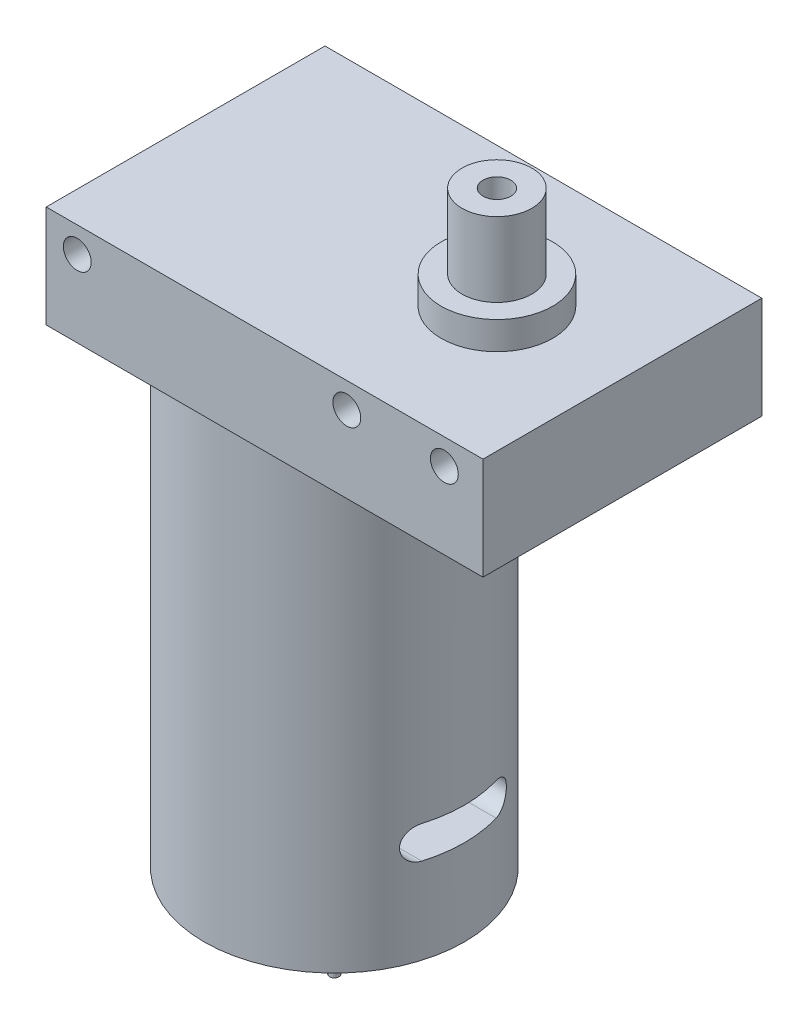
ISO-10303-21;
HEADER;
FILE_DESCRIPTION(('STEP AP214'),'2;1');
FILE_NAME('part.step','',(''),(''),'','','');
FILE_SCHEMA(('AUTOMOTIVE_DESIGN { 1 0 10303 214 1 1 1 1 }'));
ENDSEC;
DATA;
#1=APPLICATION_CONTEXT('core data for automotive mechanical design processes');
#2=APPLICATION_PROTOCOL_DEFINITION('international standard','automotive_design',2000,#1);
#3=PRODUCT_CONTEXT('',#1,'mechanical');
#4=PRODUCT('Part','Part','',(#3));
#5=PRODUCT_RELATED_PRODUCT_CATEGORY('part','',(#4));
#6=PRODUCT_DEFINITION_FORMATION('','',#4);
#7=PRODUCT_DEFINITION_CONTEXT('part definition',#1,'design');
#8=PRODUCT_DEFINITION('design','',#6,#7);
#9=PRODUCT_DEFINITION_SHAPE('','',#8);
#10=(LENGTH_UNIT() NAMED_UNIT(*) SI_UNIT(.MILLI.,.METRE.));
#11=(NAMED_UNIT(*) PLANE_ANGLE_UNIT() SI_UNIT($,.RADIAN.));
#12=(NAMED_UNIT(*) SI_UNIT($,.STERADIAN.) SOLID_ANGLE_UNIT());
#13=UNCERTAINTY_MEASURE_WITH_UNIT(LENGTH_MEASURE(1.E-05),#10,'distance_accuracy_value','');
#14=(GEOMETRIC_REPRESENTATION_CONTEXT(3) GLOBAL_UNCERTAINTY_ASSIGNED_CONTEXT((#13)) GLOBAL_UNIT_ASSIGNED_CONTEXT((#10,
#11,#12)) REPRESENTATION_CONTEXT('',''));
#15=CARTESIAN_POINT('',(0.,0.,0.));
#16=DIRECTION('',(0.,0.,1.));
#17=DIRECTION('',(1.,0.,0.));
#18=AXIS2_PLACEMENT_3D('',#15,#16,#17);
#19=CARTESIAN_POINT('',(16.,-52.,15.));
#20=DIRECTION('',(0.,-1.,0.));
#21=DIRECTION('',(0.,0.,-1.));
#22=AXIS2_PLACEMENT_3D('',#19,#20,#21);
#23=PLANE('',#22);
#24=CARTESIAN_POINT('',(16.,-52.,15.));
#25=DIRECTION('',(0.,-1.,0.));
#26=DIRECTION('',(0.,0.,-1.));
#27=AXIS2_PLACEMENT_3D('',#24,#25,#26);
#28=CIRCLE('',#27,5.);
#29=CARTESIAN_POINT('',(16.,-52.,10.));
#30=VERTEX_POINT('',#29);
#31=EDGE_CURVE('E200',#30,#30,#28,.T.);
#32=ORIENTED_EDGE('',*,*,#31,.T.);
#33=EDGE_LOOP('',(#32));
#34=FACE_BOUND('',#33,.T.);
#35=CARTESIAN_POINT('',(16.,-52.,15.));
#36=DIRECTION('',(0.,-1.,0.));
#37=DIRECTION('',(0.,0.,-1.));
#38=AXIS2_PLACEMENT_3D('',#35,#36,#37);
#39=CIRCLE('',#38,0.499999999999999);
#40=CARTESIAN_POINT('',(16.,-52.,14.5));
#41=VERTEX_POINT('',#40);
#42=EDGE_CURVE('E342',#41,#41,#39,.T.);
#43=ORIENTED_EDGE('',*,*,#42,.F.);
#44=EDGE_LOOP('',(#43));
#45=FACE_BOUND('',#44,.T.);
#46=ADVANCED_FACE('F36',(#34,#45),#23,.T.);
#47=CARTESIAN_POINT('',(16.,-50.,15.));
#48=DIRECTION('',(0.,-1.,0.));
#49=DIRECTION('',(0.,0.,-1.));
#50=AXIS2_PLACEMENT_3D('',#47,#48,#49);
#51=PLANE('',#50);
#52=CARTESIAN_POINT('',(16.,-50.,15.));
#53=DIRECTION('',(0.,-1.,0.));
#54=DIRECTION('',(0.,0.,-1.));
#55=AXIS2_PLACEMENT_3D('',#52,#53,#54);
#56=CIRCLE('',#55,14.);
#57=CARTESIAN_POINT('',(16.,-50.,0.999999999999999));
#58=VERTEX_POINT('',#57);
#59=EDGE_CURVE('E195',#58,#58,#56,.T.);
#60=ORIENTED_EDGE('',*,*,#59,.T.);
#61=EDGE_LOOP('',(#60));
#62=FACE_BOUND('',#61,.T.);
#63=CARTESIAN_POINT('',(16.,-50.,15.));
#64=DIRECTION('',(0.,-1.,0.));
#65=DIRECTION('',(0.,0.,-1.));
#66=AXIS2_PLACEMENT_3D('',#63,#64,#65);
#67=CIRCLE('',#66,5.);
#68=CARTESIAN_POINT('',(16.,-50.,10.));
#69=VERTEX_POINT('',#68);
#70=EDGE_CURVE('E198',#69,#69,#67,.T.);
#71=ORIENTED_EDGE('',*,*,#70,.F.);
#72=EDGE_LOOP('',(#71));
#73=FACE_BOUND('',#72,.T.);
#74=ADVANCED_FACE('F179',(#62,#73),#51,.T.);
#75=CARTESIAN_POINT('',(0.,0.,0.));
#76=DIRECTION('',(0.,1.,0.));
#77=DIRECTION('',(0.,0.,1.));
#78=AXIS2_PLACEMENT_3D('',#75,#76,#77);
#79=PLANE('',#78);
#80=DIRECTION('',(0.,0.,1.));
#81=VECTOR('',#80,1.);
#82=CARTESIAN_POINT('',(0.,0.,0.));
#83=LINE('',#82,#81);
#84=CARTESIAN_POINT('',(0.,0.,0.));
#85=VERTEX_POINT('',#84);
#86=CARTESIAN_POINT('',(0.,0.,30.));
#87=VERTEX_POINT('',#86);
#88=EDGE_CURVE('E221',#85,#87,#83,.T.);
#89=ORIENTED_EDGE('',*,*,#88,.F.);
#90=DIRECTION('',(-1.,0.,0.));
#91=VECTOR('',#90,1.);
#92=CARTESIAN_POINT('',(0.,0.,0.));
#93=LINE('',#92,#91);
#94=CARTESIAN_POINT('',(47.,0.,0.));
#95=VERTEX_POINT('',#94);
#96=EDGE_CURVE('E228',#95,#85,#93,.T.);
#97=ORIENTED_EDGE('',*,*,#96,.F.);
#98=DIRECTION('',(0.,0.,-1.));
#99=VECTOR('',#98,1.);
#100=CARTESIAN_POINT('',(47.,0.,0.));
#101=LINE('',#100,#99);
#102=CARTESIAN_POINT('',(47.,0.,30.));
#103=VERTEX_POINT('',#102);
#104=EDGE_CURVE('E239',#103,#95,#101,.T.);
#105=ORIENTED_EDGE('',*,*,#104,.F.);
#106=DIRECTION('',(1.,0.,0.));
#107=VECTOR('',#106,1.);
#108=CARTESIAN_POINT('',(0.,0.,30.));
#109=LINE('',#108,#107);
#110=EDGE_CURVE('E237',#87,#103,#109,.T.);
#111=ORIENTED_EDGE('',*,*,#110,.F.);
#112=EDGE_LOOP('',(#89,#97,#105,#111));
#113=FACE_BOUND('',#112,.T.);
#114=CARTESIAN_POINT('',(16.,0.,15.));
#115=DIRECTION('',(0.,1.,0.));
#116=DIRECTION('',(0.,0.,1.));
#117=AXIS2_PLACEMENT_3D('',#114,#115,#116);
#118=CIRCLE('',#117,14.);
#119=CARTESIAN_POINT('',(16.,0.,29.));
#120=VERTEX_POINT('',#119);
#121=EDGE_CURVE('E133',#120,#120,#118,.F.);
#122=ORIENTED_EDGE('',*,*,#121,.F.);
#123=EDGE_LOOP('',(#122));
#124=FACE_BOUND('',#123,.T.);
#125=ADVANCED_FACE('F184',(#113,#124),#79,.F.);
#126=CARTESIAN_POINT('',(33.5,14.,15.));
#127=DIRECTION('',(0.,1.,0.));
#128=DIRECTION('',(0.,0.,1.));
#129=AXIS2_PLACEMENT_3D('',#126,#127,#128);
#130=PLANE('',#129);
#131=CARTESIAN_POINT('',(33.5,14.,15.));
#132=DIRECTION('',(0.,1.,0.));
#133=DIRECTION('',(0.,0.,1.));
#134=AXIS2_PLACEMENT_3D('',#131,#132,#133);
#135=CIRCLE('',#134,5.99999999999999);
#136=CARTESIAN_POINT('',(33.5,14.,21.));
#137=VERTEX_POINT('',#136);
#138=EDGE_CURVE('E218',#137,#137,#135,.T.);
#139=ORIENTED_EDGE('',*,*,#138,.T.);
#140=EDGE_LOOP('',(#139));
#141=FACE_BOUND('',#140,.T.);
#142=CARTESIAN_POINT('',(33.5,14.,15.));
#143=DIRECTION('',(0.,1.,0.));
#144=DIRECTION('',(0.,0.,1.));
#145=AXIS2_PLACEMENT_3D('',#142,#143,#144);
#146=CIRCLE('',#145,3.75277674973257);
#147=CARTESIAN_POINT('',(33.5,14.,18.7527767497326));
#148=VERTEX_POINT('',#147);
#149=EDGE_CURVE('E211',#148,#148,#146,.T.);
#150=ORIENTED_EDGE('',*,*,#149,.F.);
#151=EDGE_LOOP('',(#150));
#152=FACE_BOUND('',#151,.T.);
#153=ADVANCED_FACE('F189',(#141,#152),#130,.T.);
#154=CARTESIAN_POINT('',(0.,11.,0.));
#155=DIRECTION('',(0.,1.,0.));
#156=DIRECTION('',(0.,0.,1.));
#157=AXIS2_PLACEMENT_3D('',#154,#155,#156);
#158=PLANE('',#157);
#159=DIRECTION('',(0.,0.,1.));
#160=VECTOR('',#159,1.);
#161=CARTESIAN_POINT('',(0.,11.,0.));
#162=LINE('',#161,#160);
#163=CARTESIAN_POINT('',(0.,11.,0.));
#164=VERTEX_POINT('',#163);
#165=CARTESIAN_POINT('',(0.,11.,30.));
#166=VERTEX_POINT('',#165);
#167=EDGE_CURVE('E224',#164,#166,#162,.T.);
#168=ORIENTED_EDGE('',*,*,#167,.T.);
#169=DIRECTION('',(1.,0.,0.));
#170=VECTOR('',#169,1.);
#171=CARTESIAN_POINT('',(0.,11.,30.));
#172=LINE('',#171,#170);
#173=CARTESIAN_POINT('',(47.,11.,30.));
#174=VERTEX_POINT('',#173);
#175=EDGE_CURVE('E227',#166,#174,#172,.T.);
#176=ORIENTED_EDGE('',*,*,#175,.T.);
#177=DIRECTION('',(0.,0.,-1.));
#178=VECTOR('',#177,1.);
#179=CARTESIAN_POINT('',(47.,11.,0.));
#180=LINE('',#179,#178);
#181=CARTESIAN_POINT('',(47.,11.,0.));
#182=VERTEX_POINT('',#181);
#183=EDGE_CURVE('E230',#174,#182,#180,.T.);
#184=ORIENTED_EDGE('',*,*,#183,.T.);
#185=DIRECTION('',(-1.,0.,0.));
#186=VECTOR('',#185,1.);
#187=CARTESIAN_POINT('',(0.,11.,0.));
#188=LINE('',#187,#186);
#189=EDGE_CURVE('E232',#182,#164,#188,.T.);
#190=ORIENTED_EDGE('',*,*,#189,.T.);
#191=EDGE_LOOP('',(#168,#176,#184,#190));
#192=FACE_BOUND('',#191,.T.);
#193=CARTESIAN_POINT('',(33.5,11.,15.));
#194=DIRECTION('',(0.,1.,0.));
#195=DIRECTION('',(0.,0.,1.));
#196=AXIS2_PLACEMENT_3D('',#193,#194,#195);
#197=CIRCLE('',#196,5.99999999999999);
#198=CARTESIAN_POINT('',(33.5,11.,21.));
#199=VERTEX_POINT('',#198);
#200=EDGE_CURVE('E215',#199,#199,#197,.T.);
#201=ORIENTED_EDGE('',*,*,#200,.F.);
#202=EDGE_LOOP('',(#201));
#203=FACE_BOUND('',#202,.T.);
#204=ADVANCED_FACE('F274',(#192,#203),#158,.T.);
#205=CARTESIAN_POINT('',(0.,11.,0.));
#206=DIRECTION('',(1.,0.,0.));
#207=DIRECTION('',(0.,0.,-1.));
#208=AXIS2_PLACEMENT_3D('',#205,#206,#207);
#209=PLANE('',#208);
#210=ORIENTED_EDGE('',*,*,#88,.T.);
#211=DIRECTION('',(0.,-1.,0.));
#212=VECTOR('',#211,1.);
#213=CARTESIAN_POINT('',(0.,11.,30.));
#214=LINE('',#213,#212);
#215=EDGE_CURVE('E250',#166,#87,#214,.T.);
#216=ORIENTED_EDGE('',*,*,#215,.F.);
#217=ORIENTED_EDGE('',*,*,#167,.F.);
#218=DIRECTION('',(0.,-1.,0.));
#219=VECTOR('',#218,1.);
#220=CARTESIAN_POINT('',(0.,11.,0.));
#221=LINE('',#220,#219);
#222=EDGE_CURVE('E234',#164,#85,#221,.T.);
#223=ORIENTED_EDGE('',*,*,#222,.T.);
#224=EDGE_LOOP('',(#210,#216,#217,#223));
#225=FACE_BOUND('',#224,.T.);
#226=ADVANCED_FACE('F38',(#225),#209,.F.);
#227=CARTESIAN_POINT('',(0.,11.,30.));
#228=DIRECTION('',(0.,0.,-1.));
#229=DIRECTION('',(-1.,0.,0.));
#230=AXIS2_PLACEMENT_3D('',#227,#228,#229);
#231=PLANE('',#230);
#232=CARTESIAN_POINT('',(42.8407573826274,8.25,30.));
#233=DIRECTION('',(0.,0.,1.));
#234=DIRECTION('',(1.,0.,0.));
#235=AXIS2_PLACEMENT_3D('',#232,#233,#234);
#236=CIRCLE('',#235,1.5);
#237=CARTESIAN_POINT('',(44.3407573826274,8.25,30.));
#238=VERTEX_POINT('',#237);
#239=EDGE_CURVE('E299',#238,#238,#236,.T.);
#240=ORIENTED_EDGE('',*,*,#239,.F.);
#241=EDGE_LOOP('',(#240));
#242=FACE_BOUND('',#241,.T.);
#243=CARTESIAN_POINT('',(32.3407573826274,8.25,30.));
#244=DIRECTION('',(0.,0.,1.));
#245=DIRECTION('',(1.,0.,0.));
#246=AXIS2_PLACEMENT_3D('',#243,#244,#245);
#247=CIRCLE('',#246,1.5);
#248=CARTESIAN_POINT('',(33.8407573826274,8.25,30.));
#249=VERTEX_POINT('',#248);
#250=EDGE_CURVE('E303',#249,#249,#247,.T.);
#251=ORIENTED_EDGE('',*,*,#250,.F.);
#252=EDGE_LOOP('',(#251));
#253=FACE_BOUND('',#252,.T.);
#254=CARTESIAN_POINT('',(3.34075738262738,8.25,30.));
#255=DIRECTION('',(0.,0.,1.));
#256=DIRECTION('',(1.,0.,0.));
#257=AXIS2_PLACEMENT_3D('',#254,#255,#256);
#258=CIRCLE('',#257,1.5);
#259=CARTESIAN_POINT('',(4.84075738262738,8.25,30.));
#260=VERTEX_POINT('',#259);
#261=EDGE_CURVE('E206',#260,#260,#258,.T.);
#262=ORIENTED_EDGE('',*,*,#261,.F.);
#263=EDGE_LOOP('',(#262));
#264=FACE_BOUND('',#263,.T.);
#265=ORIENTED_EDGE('',*,*,#110,.T.);
#266=DIRECTION('',(0.,-1.,0.));
#267=VECTOR('',#266,1.);
#268=CARTESIAN_POINT('',(47.,11.,30.));
#269=LINE('',#268,#267);
#270=EDGE_CURVE('E247',#174,#103,#269,.T.);
#271=ORIENTED_EDGE('',*,*,#270,.F.);
#272=ORIENTED_EDGE('',*,*,#175,.F.);
#273=ORIENTED_EDGE('',*,*,#215,.T.);
#274=EDGE_LOOP('',(#265,#271,#272,#273));
#275=FACE_BOUND('',#274,.T.);
#276=ADVANCED_FACE('F288',(#242,#253,#264,#275),#231,.F.);
#277=CARTESIAN_POINT('',(47.,11.,0.));
#278=DIRECTION('',(-1.,0.,0.));
#279=DIRECTION('',(0.,0.,1.));
#280=AXIS2_PLACEMENT_3D('',#277,#278,#279);
#281=PLANE('',#280);
#282=ORIENTED_EDGE('',*,*,#104,.T.);
#283=DIRECTION('',(0.,-1.,0.));
#284=VECTOR('',#283,1.);
#285=CARTESIAN_POINT('',(47.,11.,0.));
#286=LINE('',#285,#284);
#287=EDGE_CURVE('E244',#182,#95,#286,.T.);
#288=ORIENTED_EDGE('',*,*,#287,.F.);
#289=ORIENTED_EDGE('',*,*,#183,.F.);
#290=ORIENTED_EDGE('',*,*,#270,.T.);
#291=EDGE_LOOP('',(#282,#288,#289,#290));
#292=FACE_BOUND('',#291,.T.);
#293=ADVANCED_FACE('F285',(#292),#281,.F.);
#294=CARTESIAN_POINT('',(0.,11.,0.));
#295=DIRECTION('',(0.,0.,1.));
#296=DIRECTION('',(1.,0.,0.));
#297=AXIS2_PLACEMENT_3D('',#294,#295,#296);
#298=PLANE('',#297);
#299=CARTESIAN_POINT('',(42.8407573826274,8.25,0.));
#300=DIRECTION('',(0.,0.,1.));
#301=DIRECTION('',(1.,0.,0.));
#302=AXIS2_PLACEMENT_3D('',#299,#300,#301);
#303=CIRCLE('',#302,1.5);
#304=CARTESIAN_POINT('',(44.3407573826274,8.25,0.));
#305=VERTEX_POINT('',#304);
#306=EDGE_CURVE('E326',#305,#305,#303,.T.);
#307=ORIENTED_EDGE('',*,*,#306,.T.);
#308=EDGE_LOOP('',(#307));
#309=FACE_BOUND('',#308,.T.);
#310=CARTESIAN_POINT('',(32.3407573826274,8.25,0.));
#311=DIRECTION('',(0.,0.,1.));
#312=DIRECTION('',(1.,0.,0.));
#313=AXIS2_PLACEMENT_3D('',#310,#311,#312);
#314=CIRCLE('',#313,1.5);
#315=CARTESIAN_POINT('',(33.8407573826274,8.25,0.));
#316=VERTEX_POINT('',#315);
#317=EDGE_CURVE('E322',#316,#316,#314,.T.);
#318=ORIENTED_EDGE('',*,*,#317,.T.);
#319=EDGE_LOOP('',(#318));
#320=FACE_BOUND('',#319,.T.);
#321=CARTESIAN_POINT('',(3.34075738262738,8.25,0.));
#322=DIRECTION('',(0.,0.,1.));
#323=DIRECTION('',(1.,0.,0.));
#324=AXIS2_PLACEMENT_3D('',#321,#322,#323);
#325=CIRCLE('',#324,1.5);
#326=CARTESIAN_POINT('',(4.84075738262738,8.25,0.));
#327=VERTEX_POINT('',#326);
#328=EDGE_CURVE('E201',#327,#327,#325,.T.);
#329=ORIENTED_EDGE('',*,*,#328,.T.);
#330=EDGE_LOOP('',(#329));
#331=FACE_BOUND('',#330,.T.);
#332=ORIENTED_EDGE('',*,*,#96,.T.);
#333=ORIENTED_EDGE('',*,*,#222,.F.);
#334=ORIENTED_EDGE('',*,*,#189,.F.);
#335=ORIENTED_EDGE('',*,*,#287,.T.);
#336=EDGE_LOOP('',(#332,#333,#334,#335));
#337=FACE_BOUND('',#336,.T.);
#338=ADVANCED_FACE('F278',(#309,#320,#331,#337),#298,.F.);
#339=CARTESIAN_POINT('',(33.5,14.,15.));
#340=DIRECTION('',(0.,-1.,0.));
#341=DIRECTION('',(0.,0.,-1.));
#342=AXIS2_PLACEMENT_3D('',#339,#340,#341);
#343=CYLINDRICAL_SURFACE('',#342,5.99999999999999);
#344=ORIENTED_EDGE('',*,*,#138,.F.);
#345=EDGE_LOOP('',(#344));
#346=FACE_BOUND('',#345,.T.);
#347=ORIENTED_EDGE('',*,*,#200,.T.);
#348=EDGE_LOOP('',(#347));
#349=FACE_BOUND('',#348,.T.);
#350=ADVANCED_FACE('F266',(#346,#349),#343,.T.);
#351=CARTESIAN_POINT('',(33.5,22.,15.));
#352=DIRECTION('',(0.,-1.,0.));
#353=DIRECTION('',(0.,0.,-1.));
#354=AXIS2_PLACEMENT_3D('',#351,#352,#353);
#355=CYLINDRICAL_SURFACE('',#354,3.75277674973257);
#356=CARTESIAN_POINT('',(33.5,22.,15.));
#357=DIRECTION('',(0.,1.,0.));
#358=DIRECTION('',(0.,0.,1.));
#359=AXIS2_PLACEMENT_3D('',#356,#357,#358);
#360=CIRCLE('',#359,3.75277674973257);
#361=CARTESIAN_POINT('',(33.5,22.,18.7527767497326));
#362=VERTEX_POINT('',#361);
#363=EDGE_CURVE('E212',#362,#362,#360,.T.);
#364=ORIENTED_EDGE('',*,*,#363,.F.);
#365=EDGE_LOOP('',(#364));
#366=FACE_BOUND('',#365,.T.);
#367=ORIENTED_EDGE('',*,*,#149,.T.);
#368=EDGE_LOOP('',(#367));
#369=FACE_BOUND('',#368,.T.);
#370=ADVANCED_FACE('F261',(#366,#369),#355,.T.);
#371=CARTESIAN_POINT('',(33.5,22.,15.));
#372=DIRECTION('',(0.,1.,0.));
#373=DIRECTION('',(0.,0.,1.));
#374=AXIS2_PLACEMENT_3D('',#371,#372,#373);
#375=PLANE('',#374);
#376=CARTESIAN_POINT('',(33.5,22.,15.));
#377=DIRECTION('',(0.,1.,0.));
#378=DIRECTION('',(0.,0.,1.));
#379=AXIS2_PLACEMENT_3D('',#376,#377,#378);
#380=CIRCLE('',#379,1.5);
#381=CARTESIAN_POINT('',(33.5,22.,16.5));
#382=VERTEX_POINT('',#381);
#383=EDGE_CURVE('E336',#382,#382,#380,.T.);
#384=ORIENTED_EDGE('',*,*,#383,.F.);
#385=EDGE_LOOP('',(#384));
#386=FACE_BOUND('',#385,.T.);
#387=ORIENTED_EDGE('',*,*,#363,.T.);
#388=EDGE_LOOP('',(#387));
#389=FACE_BOUND('',#388,.T.);
#390=ADVANCED_FACE('F257',(#386,#389),#375,.T.);
#391=CARTESIAN_POINT('',(16.,-50.,15.));
#392=DIRECTION('',(0.,1.,0.));
#393=DIRECTION('',(0.,0.,1.));
#394=AXIS2_PLACEMENT_3D('',#391,#392,#393);
#395=CYLINDRICAL_SURFACE('',#394,14.);
#396=CARTESIAN_POINT('',(16.,-37.25,15.));
#397=DIRECTION('',(0.,1.,0.));
#398=DIRECTION('',(0.,0.,1.));
#399=AXIS2_PLACEMENT_3D('',#396,#397,#398);
#400=CIRCLE('',#399,14.);
#401=CARTESIAN_POINT('',(29.4164078649987,-37.25,19.));
#402=VERTEX_POINT('',#401);
#403=CARTESIAN_POINT('',(29.4164078649987,-37.25,11.));
#404=VERTEX_POINT('',#403);
#405=EDGE_CURVE('E50',#402,#404,#400,.T.);
#406=ORIENTED_EDGE('',*,*,#405,.T.);
#407=CARTESIAN_POINT('',(29.4164078649987,-37.25,11.));
#408=CARTESIAN_POINT('',(29.4009505736263,-37.2500013571118,10.9481484949685));
#409=CARTESIAN_POINT('',(29.3851973115395,-37.2523055307532,10.8964157711557));
#410=CARTESIAN_POINT('',(29.3532147991357,-37.2614565880063,10.793510955877));
#411=CARTESIAN_POINT('',(29.3369856267093,-37.2683027321719,10.7423387745314));
#412=CARTESIAN_POINT('',(29.2877938697727,-37.2955368395137,10.5902565545779));
#413=CARTESIAN_POINT('',(29.2542855074683,-37.3226208280629,10.4906418556386));
#414=CARTESIAN_POINT('',(29.1871085445877,-37.3937618037879,10.2978066692511));
#415=CARTESIAN_POINT('',(29.1534399584964,-37.4378172844213,10.2045856151103));
#416=CARTESIAN_POINT('',(29.0873160978216,-37.5418242311756,10.0269589491946));
#417=CARTESIAN_POINT('',(29.0548608734129,-37.6017763538264,9.94255370171244));
#418=CARTESIAN_POINT('',(28.9927082129094,-37.7363129722698,9.78495172650631));
#419=CARTESIAN_POINT('',(28.9630137347517,-37.8109129018539,9.71176696745845));
#420=CARTESIAN_POINT('',(28.9081408210273,-37.9729763720471,9.57920123949276));
#421=CARTESIAN_POINT('',(28.8829612012622,-38.0604365285721,9.5198166497269));
#422=CARTESIAN_POINT('',(28.8400678609597,-38.2407905983935,9.42008464083569));
#423=CARTESIAN_POINT('',(28.8220214668572,-38.3331267782414,9.37887456115723));
#424=CARTESIAN_POINT('',(28.792856208973,-38.5244914044475,9.31280807060966));
#425=CARTESIAN_POINT('',(28.7817324365737,-38.6235150535723,9.28794007137376));
#426=CARTESIAN_POINT('',(28.7679141926918,-38.8165861443776,9.25712389021523));
#427=CARTESIAN_POINT('',(28.7645989858497,-38.910368367026,9.24978176852281));
#428=CARTESIAN_POINT('',(28.7648002145439,-39.0978786214009,9.25022794714364));
#429=CARTESIAN_POINT('',(28.7683149487971,-39.1916066608068,9.25801247952979));
#430=CARTESIAN_POINT('',(28.7816324505206,-39.3723670827669,9.28772240836042));
#431=CARTESIAN_POINT('',(28.7911738742804,-39.4595167756579,9.30906027865145));
#432=CARTESIAN_POINT('',(28.8156789258599,-39.6288527787751,9.36446234825145));
#433=CARTESIAN_POINT('',(28.8306432082558,-39.7110384884169,9.39852808391608));
#434=CARTESIAN_POINT('',(28.8657072862595,-39.8712045293316,9.47953086272761));
#435=CARTESIAN_POINT('',(28.8859627732998,-39.9489506995042,9.52686200562511));
#436=CARTESIAN_POINT('',(28.9302506270026,-40.0955071563769,9.63232964481147));
#437=CARTESIAN_POINT('',(28.9542839804562,-40.1643150997823,9.69046896495843));
#438=CARTESIAN_POINT('',(29.0069786357766,-40.2966622870333,9.82082906794614));
#439=CARTESIAN_POINT('',(29.0358537895784,-40.359387987224,9.89378938030897));
#440=CARTESIAN_POINT('',(29.0954064187095,-40.4718465493623,10.0485150622465));
#441=CARTESIAN_POINT('',(29.1260851400704,-40.5215702963118,10.1302865524754));
#442=CARTESIAN_POINT('',(29.1901069809206,-40.6098689206112,10.3063422686669));
#443=CARTESIAN_POINT('',(29.22349102076,-40.6474751239935,10.4010976432122));
#444=CARTESIAN_POINT('',(29.2896065183108,-40.7057035538527,10.595810720767));
#445=CARTESIAN_POINT('',(29.3223388898936,-40.7263514808374,10.695760306509));
#446=CARTESIAN_POINT('',(29.3647670860905,-40.7421087531431,10.8305561176962));
#447=CARTESIAN_POINT('',(29.3752648014799,-40.7450661787456,10.8643557979106));
#448=CARTESIAN_POINT('',(29.3960189922165,-40.7490093996228,10.9320861901119));
#449=CARTESIAN_POINT('',(29.4062758160628,-40.7499982419191,10.9660166180242));
#450=CARTESIAN_POINT('',(29.4164078649987,-40.75,11.));
#451=B_SPLINE_CURVE_WITH_KNOTS('',3,(#407,#408,#409,#410,#411,#412,#413,#414,#415,#416,#417,
#418,#419,#420,#421,#422,#423,#424,#425,#426,#427,#428,#429,#430,#431,#432,#433,#434,#435,#436,
#437,#438,#439,#440,#441,#442,#443,#444,#445,#446,#447,#448,#449,#450),.UNSPECIFIED.,.F.,.F.,(4,
2,2,2,2,2,2,2,2,2,2,2,2,2,2,2,2,2,2,2,2,4),(0.,0.162213269936145,0.324400137557104,
0.648344274287916,0.972259661442537,1.29618842835805,1.62046035516602,1.94464710415035,
2.25112638604724,2.55738810459366,2.83833541570881,3.11921275409341,3.38867553347052,
3.65817084968474,3.93672331399788,4.21534865840365,4.51542624864582,4.81571364717901,
5.13609483521936,5.45598958039699,5.56249570636635,5.66883685095987),.UNSPECIFIED.);
#452=CARTESIAN_POINT('',(29.4164078649987,-40.75,11.));
#453=VERTEX_POINT('',#452);
#454=EDGE_CURVE('E11',#404,#453,#451,.T.);
#455=ORIENTED_EDGE('',*,*,#454,.T.);
#456=CARTESIAN_POINT('',(16.,-40.75,15.));
#457=DIRECTION('',(0.,-1.,0.));
#458=DIRECTION('',(0.,0.,-1.));
#459=AXIS2_PLACEMENT_3D('',#456,#457,#458);
#460=CIRCLE('',#459,14.);
#461=CARTESIAN_POINT('',(29.4164078649987,-40.75,19.));
#462=VERTEX_POINT('',#461);
#463=EDGE_CURVE('E104',#453,#462,#460,.T.);
#464=ORIENTED_EDGE('',*,*,#463,.T.);
#465=CARTESIAN_POINT('',(29.4164078649987,-40.75,19.));
#466=CARTESIAN_POINT('',(29.4009505736263,-40.7499986428882,19.0518515050315));
#467=CARTESIAN_POINT('',(29.3851973115395,-40.7476944692468,19.1035842288443));
#468=CARTESIAN_POINT('',(29.3532147991357,-40.7385434119937,19.206489044123));
#469=CARTESIAN_POINT('',(29.3369856267093,-40.7316972678281,19.2576612254686));
#470=CARTESIAN_POINT('',(29.2877938697727,-40.7044631604863,19.4097434454221));
#471=CARTESIAN_POINT('',(29.2542855074683,-40.6773791719372,19.5093581443614));
#472=CARTESIAN_POINT('',(29.1871085445877,-40.6062381962121,19.7021933307489));
#473=CARTESIAN_POINT('',(29.1534399584964,-40.5621827155787,19.7954143848897));
#474=CARTESIAN_POINT('',(29.0873160978216,-40.4581757688245,19.9730410508054));
#475=CARTESIAN_POINT('',(29.0548608734129,-40.3982236461737,20.0574462982876));
#476=CARTESIAN_POINT('',(28.9927082129094,-40.2636870277302,20.2150482734937));
#477=CARTESIAN_POINT('',(28.9630137347517,-40.1890870981461,20.2882330325415));
#478=CARTESIAN_POINT('',(28.9081408210273,-40.0270236279529,20.4207987605072));
#479=CARTESIAN_POINT('',(28.8829612012622,-39.9395634714279,20.4801833502731));
#480=CARTESIAN_POINT('',(28.8400678609597,-39.7592094016065,20.5799153591643));
#481=CARTESIAN_POINT('',(28.8220214668572,-39.6668732217586,20.6211254388428));
#482=CARTESIAN_POINT('',(28.792856208973,-39.4755085955525,20.6871919293903));
#483=CARTESIAN_POINT('',(28.7817324365737,-39.3764849464277,20.7120599286262));
#484=CARTESIAN_POINT('',(28.7679141926918,-39.1834138556224,20.7428761097848));
#485=CARTESIAN_POINT('',(28.7645989858497,-39.089631632974,20.7502182314772));
#486=CARTESIAN_POINT('',(28.7648002145439,-38.9021213785991,20.7497720528564));
#487=CARTESIAN_POINT('',(28.7683149487971,-38.8083933391932,20.7419875204702));
#488=CARTESIAN_POINT('',(28.7816324505206,-38.6276329172332,20.7122775916396));
#489=CARTESIAN_POINT('',(28.7911738742804,-38.5404832243421,20.6909397213485));
#490=CARTESIAN_POINT('',(28.8156789258599,-38.3711472212249,20.6355376517485));
#491=CARTESIAN_POINT('',(28.8306432082558,-38.2889615115832,20.6014719160839));
#492=CARTESIAN_POINT('',(28.8657072862595,-38.1287954706684,20.5204691372724));
#493=CARTESIAN_POINT('',(28.8859627732998,-38.0510493004958,20.4731379943749));
#494=CARTESIAN_POINT('',(28.9302506270026,-37.9044928436232,20.3676703551885));
#495=CARTESIAN_POINT('',(28.9542839804562,-37.8356849002177,20.3095310350416));
#496=CARTESIAN_POINT('',(29.0069786357766,-37.7033377129667,20.1791709320538));
#497=CARTESIAN_POINT('',(29.0358537895785,-37.640612012776,20.106210619691));
#498=CARTESIAN_POINT('',(29.0954064187095,-37.5281534506377,19.9514849377535));
#499=CARTESIAN_POINT('',(29.1260851400704,-37.4784297036882,19.8697134475246));
#500=CARTESIAN_POINT('',(29.1901069809206,-37.3901310793888,19.6936577313331));
#501=CARTESIAN_POINT('',(29.22349102076,-37.3525248760065,19.5989023567878));
#502=CARTESIAN_POINT('',(29.2896065183108,-37.2942964461473,19.4041892792329));
#503=CARTESIAN_POINT('',(29.3223388898936,-37.2736485191626,19.304239693491));
#504=CARTESIAN_POINT('',(29.3647670860905,-37.2578912468569,19.1694438823038));
#505=CARTESIAN_POINT('',(29.3752648014799,-37.2549338212544,19.1356442020894));
#506=CARTESIAN_POINT('',(29.3960189922165,-37.2509906003772,19.0679138098881));
#507=CARTESIAN_POINT('',(29.4062758160628,-37.2500017580809,19.0339833819758));
#508=CARTESIAN_POINT('',(29.4164078649987,-37.25,19.));
#509=B_SPLINE_CURVE_WITH_KNOTS('',3,(#465,#466,#467,#468,#469,#470,#471,#472,#473,#474,#475,
#476,#477,#478,#479,#480,#481,#482,#483,#484,#485,#486,#487,#488,#489,#490,#491,#492,#493,#494,
#495,#496,#497,#498,#499,#500,#501,#502,#503,#504,#505,#506,#507,#508),.UNSPECIFIED.,.F.,.F.,(4,
2,2,2,2,2,2,2,2,2,2,2,2,2,2,2,2,2,2,2,2,4),(0.,0.162213269936145,0.324400137557107,
0.648344274287922,0.972259661442547,1.29618842835806,1.62046035516602,1.94464710415035,
2.25112638604724,2.55738810459367,2.83833541570882,3.11921275409342,3.38867553347051,
3.65817084968475,3.93672331399789,4.21534865840366,4.51542624864583,4.81571364717902,
5.13609483521937,5.455989580397,5.56249570636635,5.66883685095987),.UNSPECIFIED.);
#510=EDGE_CURVE('E108',#462,#402,#509,.T.);
#511=ORIENTED_EDGE('',*,*,#510,.T.);
#512=EDGE_LOOP('',(#406,#455,#464,#511));
#513=FACE_BOUND('',#512,.T.);
#514=CARTESIAN_POINT('',(2.58359213500126,-40.75,19.));
#515=VERTEX_POINT('',#514);
#516=CARTESIAN_POINT('',(2.58359213500126,-40.75,11.));
#517=VERTEX_POINT('',#516);
#518=EDGE_CURVE('E111',#515,#517,#460,.T.);
#519=ORIENTED_EDGE('',*,*,#518,.T.);
#520=CARTESIAN_POINT('',(2.58359213500126,-40.75,11.));
#521=CARTESIAN_POINT('',(2.59904942637373,-40.7499986428882,10.9481484949685));
#522=CARTESIAN_POINT('',(2.61480268846053,-40.7476944692468,10.8964157711557));
#523=CARTESIAN_POINT('',(2.6467852008643,-40.7385434119937,10.793510955877));
#524=CARTESIAN_POINT('',(2.66301437329067,-40.7316972678281,10.7423387745314));
#525=CARTESIAN_POINT('',(2.71220613022727,-40.7044631604863,10.5902565545779));
#526=CARTESIAN_POINT('',(2.74571449253172,-40.6773791719372,10.4906418556386));
#527=CARTESIAN_POINT('',(2.81289145541228,-40.6062381962121,10.2978066692511));
#528=CARTESIAN_POINT('',(2.84656004150355,-40.5621827155787,10.2045856151103));
#529=CARTESIAN_POINT('',(2.91268390217843,-40.4581757688245,10.0269589491946));
#530=CARTESIAN_POINT('',(2.94513912658714,-40.3982236461737,9.94255370171245));
#531=CARTESIAN_POINT('',(3.00729178709057,-40.2636870277302,9.78495172650631));
#532=CARTESIAN_POINT('',(3.03698626524831,-40.1890870981461,9.71176696745846));
#533=CARTESIAN_POINT('',(3.09185917897273,-40.0270236279529,9.57920123949277));
#534=CARTESIAN_POINT('',(3.11703879873781,-39.9395634714279,9.51981664972691));
#535=CARTESIAN_POINT('',(3.15993213904033,-39.7592094016065,9.42008464083569));
#536=CARTESIAN_POINT('',(3.17797853314276,-39.6668732217586,9.37887456115723));
#537=CARTESIAN_POINT('',(3.20714379102703,-39.4755085955525,9.31280807060967));
#538=CARTESIAN_POINT('',(3.21826756342633,-39.3764849464277,9.28794007137376));
#539=CARTESIAN_POINT('',(3.23208580730823,-39.1834138556224,9.25712389021523));
#540=CARTESIAN_POINT('',(3.23540101415032,-39.089631632974,9.24978176852281));
#541=CARTESIAN_POINT('',(3.23519978545613,-38.9021213785991,9.25022794714364));
#542=CARTESIAN_POINT('',(3.23168505120289,-38.8083933391932,9.25801247952979));
#543=CARTESIAN_POINT('',(3.21836754947936,-38.6276329172332,9.28772240836042));
#544=CARTESIAN_POINT('',(3.20882612571964,-38.5404832243421,9.30906027865145));
#545=CARTESIAN_POINT('',(3.18432107414011,-38.3711472212249,9.36446234825146));
#546=CARTESIAN_POINT('',(3.16935679174424,-38.2889615115832,9.39852808391609));
#547=CARTESIAN_POINT('',(3.13429271374046,-38.1287954706684,9.47953086272761));
#548=CARTESIAN_POINT('',(3.1140372267002,-38.0510493004958,9.52686200562511));
#549=CARTESIAN_POINT('',(3.06974937299741,-37.9044928436232,9.63232964481147));
#550=CARTESIAN_POINT('',(3.04571601954377,-37.8356849002177,9.69046896495843));
#551=CARTESIAN_POINT('',(2.99302136422336,-37.7033377129667,9.82082906794614));
#552=CARTESIAN_POINT('',(2.96414621042155,-37.640612012776,9.89378938030897));
#553=CARTESIAN_POINT('',(2.90459358129052,-37.5281534506377,10.0485150622465));
#554=CARTESIAN_POINT('',(2.87391485992958,-37.4784297036882,10.1302865524754));
#555=CARTESIAN_POINT('',(2.80989301907936,-37.3901310793888,10.3063422686669));
#556=CARTESIAN_POINT('',(2.77650897924005,-37.3525248760065,10.4010976432122));
#557=CARTESIAN_POINT('',(2.71039348168924,-37.2942964461473,10.5958107207671));
#558=CARTESIAN_POINT('',(2.67766111010641,-37.2736485191626,10.695760306509));
#559=CARTESIAN_POINT('',(2.63523291390952,-37.2578912468569,10.8305561176962));
#560=CARTESIAN_POINT('',(2.62473519852007,-37.2549338212544,10.8643557979106));
#561=CARTESIAN_POINT('',(2.60398100778354,-37.2509906003772,10.9320861901119));
#562=CARTESIAN_POINT('',(2.59372418393721,-37.2500017580809,10.9660166180242));
#563=CARTESIAN_POINT('',(2.58359213500126,-37.25,11.));
#564=B_SPLINE_CURVE_WITH_KNOTS('',3,(#520,#521,#522,#523,#524,#525,#526,#527,#528,#529,#530,
#531,#532,#533,#534,#535,#536,#537,#538,#539,#540,#541,#542,#543,#544,#545,#546,#547,#548,#549,
#550,#551,#552,#553,#554,#555,#556,#557,#558,#559,#560,#561,#562,#563),.UNSPECIFIED.,.F.,.F.,(4,
2,2,2,2,2,2,2,2,2,2,2,2,2,2,2,2,2,2,2,2,4),(0.,0.162213269936145,0.324400137557103,
0.648344274287918,0.97225966144254,1.29618842835805,1.62046035516602,1.94464710415035,
2.25112638604724,2.55738810459366,2.83833541570881,3.11921275409341,3.38867553347052,
3.65817084968474,3.93672331399788,4.21534865840365,4.51542624864582,4.81571364717901,
5.13609483521936,5.45598958039699,5.56249570636635,5.66883685095987),.UNSPECIFIED.);
#565=CARTESIAN_POINT('',(2.58359213500126,-37.25,11.));
#566=VERTEX_POINT('',#565);
#567=EDGE_CURVE('E109',#517,#566,#564,.T.);
#568=ORIENTED_EDGE('',*,*,#567,.T.);
#569=CARTESIAN_POINT('',(2.58359213500126,-37.25,19.));
#570=VERTEX_POINT('',#569);
#571=EDGE_CURVE('E127',#566,#570,#400,.T.);
#572=ORIENTED_EDGE('',*,*,#571,.T.);
#573=CARTESIAN_POINT('',(2.58359213500126,-37.25,19.));
#574=CARTESIAN_POINT('',(2.59904942637373,-37.2500013571118,19.0518515050315));
#575=CARTESIAN_POINT('',(2.61480268846053,-37.2523055307532,19.1035842288443));
#576=CARTESIAN_POINT('',(2.6467852008643,-37.2614565880063,19.206489044123));
#577=CARTESIAN_POINT('',(2.66301437329067,-37.2683027321719,19.2576612254686));
#578=CARTESIAN_POINT('',(2.71220613022727,-37.2955368395137,19.4097434454221));
#579=CARTESIAN_POINT('',(2.74571449253172,-37.3226208280629,19.5093581443614));
#580=CARTESIAN_POINT('',(2.81289145541228,-37.3937618037879,19.7021933307489));
#581=CARTESIAN_POINT('',(2.84656004150355,-37.4378172844213,19.7954143848897));
#582=CARTESIAN_POINT('',(2.91268390217843,-37.5418242311756,19.9730410508054));
#583=CARTESIAN_POINT('',(2.94513912658714,-37.6017763538264,20.0574462982875));
#584=CARTESIAN_POINT('',(3.00729178709056,-37.7363129722698,20.2150482734937));
#585=CARTESIAN_POINT('',(3.03698626524831,-37.8109129018539,20.2882330325415));
#586=CARTESIAN_POINT('',(3.09185917897273,-37.9729763720471,20.4207987605072));
#587=CARTESIAN_POINT('',(3.11703879873781,-38.0604365285721,20.4801833502731));
#588=CARTESIAN_POINT('',(3.15993213904033,-38.2407905983935,20.5799153591643));
#589=CARTESIAN_POINT('',(3.17797853314276,-38.3331267782414,20.6211254388428));
#590=CARTESIAN_POINT('',(3.20714379102703,-38.5244914044475,20.6871919293903));
#591=CARTESIAN_POINT('',(3.21826756342633,-38.6235150535723,20.7120599286262));
#592=CARTESIAN_POINT('',(3.23208580730823,-38.8165861443776,20.7428761097848));
#593=CARTESIAN_POINT('',(3.23540101415032,-38.910368367026,20.7502182314772));
#594=CARTESIAN_POINT('',(3.23519978545613,-39.0978786214009,20.7497720528564));
#595=CARTESIAN_POINT('',(3.23168505120288,-39.1916066608068,20.7419875204702));
#596=CARTESIAN_POINT('',(3.21836754947936,-39.3723670827669,20.7122775916396));
#597=CARTESIAN_POINT('',(3.20882612571964,-39.4595167756579,20.6909397213485));
#598=CARTESIAN_POINT('',(3.18432107414011,-39.6288527787751,20.6355376517485));
#599=CARTESIAN_POINT('',(3.16935679174424,-39.7110384884169,20.6014719160839));
#600=CARTESIAN_POINT('',(3.13429271374046,-39.8712045293316,20.5204691372724));
#601=CARTESIAN_POINT('',(3.11403722670019,-39.9489506995042,20.4731379943749));
#602=CARTESIAN_POINT('',(3.06974937299741,-40.0955071563769,20.3676703551885));
#603=CARTESIAN_POINT('',(3.04571601954377,-40.1643150997823,20.3095310350416));
#604=CARTESIAN_POINT('',(2.99302136422336,-40.2966622870333,20.1791709320539));
#605=CARTESIAN_POINT('',(2.96414621042155,-40.359387987224,20.106210619691));
#606=CARTESIAN_POINT('',(2.90459358129052,-40.4718465493623,19.9514849377535));
#607=CARTESIAN_POINT('',(2.87391485992958,-40.5215702963118,19.8697134475246));
#608=CARTESIAN_POINT('',(2.80989301907936,-40.6098689206112,19.6936577313331));
#609=CARTESIAN_POINT('',(2.77650897924005,-40.6474751239935,19.5989023567878));
#610=CARTESIAN_POINT('',(2.71039348168924,-40.7057035538527,19.4041892792329));
#611=CARTESIAN_POINT('',(2.67766111010641,-40.7263514808374,19.304239693491));
#612=CARTESIAN_POINT('',(2.63523291390952,-40.7421087531431,19.1694438823038));
#613=CARTESIAN_POINT('',(2.62473519852007,-40.7450661787456,19.1356442020894));
#614=CARTESIAN_POINT('',(2.60398100778354,-40.7490093996228,19.0679138098881));
#615=CARTESIAN_POINT('',(2.59372418393721,-40.7499982419191,19.0339833819758));
#616=CARTESIAN_POINT('',(2.58359213500126,-40.75,19.));
#617=B_SPLINE_CURVE_WITH_KNOTS('',3,(#573,#574,#575,#576,#577,#578,#579,#580,#581,#582,#583,
#584,#585,#586,#587,#588,#589,#590,#591,#592,#593,#594,#595,#596,#597,#598,#599,#600,#601,#602,
#603,#604,#605,#606,#607,#608,#609,#610,#611,#612,#613,#614,#615,#616),.UNSPECIFIED.,.F.,.F.,(4,
2,2,2,2,2,2,2,2,2,2,2,2,2,2,2,2,2,2,2,2,4),(0.,0.162213269936141,0.3244001375571,
0.648344274287918,0.972259661442537,1.29618842835805,1.62046035516602,1.94464710415035,
2.25112638604723,2.55738810459366,2.83833541570882,3.11921275409341,3.38867553347052,
3.65817084968475,3.93672331399788,4.21534865840365,4.51542624864583,4.81571364717902,
5.13609483521936,5.45598958039699,5.56249570636636,5.66883685095988),.UNSPECIFIED.);
#618=EDGE_CURVE('E131',#570,#515,#617,.T.);
#619=ORIENTED_EDGE('',*,*,#618,.T.);
#620=EDGE_LOOP('',(#519,#568,#572,#619));
#621=FACE_BOUND('',#620,.T.);
#622=ORIENTED_EDGE('',*,*,#59,.F.);
#623=EDGE_LOOP('',(#622));
#624=FACE_BOUND('',#623,.T.);
#625=ORIENTED_EDGE('',*,*,#121,.T.);
#626=EDGE_LOOP('',(#625));
#627=FACE_BOUND('',#626,.T.);
#628=ADVANCED_FACE('F121',(#513,#621,#624,#627),#395,.T.);
#629=CARTESIAN_POINT('',(16.,-52.,15.));
#630=DIRECTION('',(0.,1.,0.));
#631=DIRECTION('',(0.,0.,1.));
#632=AXIS2_PLACEMENT_3D('',#629,#630,#631);
#633=CYLINDRICAL_SURFACE('',#632,5.);
#634=ORIENTED_EDGE('',*,*,#31,.F.);
#635=EDGE_LOOP('',(#634));
#636=FACE_BOUND('',#635,.T.);
#637=ORIENTED_EDGE('',*,*,#70,.T.);
#638=EDGE_LOOP('',(#637));
#639=FACE_BOUND('',#638,.T.);
#640=ADVANCED_FACE('F175',(#636,#639),#633,.T.);
#641=CARTESIAN_POINT('',(3.34075738262738,8.25,0.));
#642=DIRECTION('',(0.,0.,1.));
#643=DIRECTION('',(1.,0.,0.));
#644=AXIS2_PLACEMENT_3D('',#641,#642,#643);
#645=CYLINDRICAL_SURFACE('',#644,1.5);
#646=ORIENTED_EDGE('',*,*,#328,.F.);
#647=EDGE_LOOP('',(#646));
#648=FACE_BOUND('',#647,.T.);
#649=ORIENTED_EDGE('',*,*,#261,.T.);
#650=EDGE_LOOP('',(#649));
#651=FACE_BOUND('',#650,.T.);
#652=ADVANCED_FACE('F171',(#648,#651),#645,.F.);
#653=CARTESIAN_POINT('',(32.3407573826274,8.25,0.));
#654=DIRECTION('',(0.,0.,1.));
#655=DIRECTION('',(1.,0.,0.));
#656=AXIS2_PLACEMENT_3D('',#653,#654,#655);
#657=CYLINDRICAL_SURFACE('',#656,1.5);
#658=ORIENTED_EDGE('',*,*,#317,.F.);
#659=EDGE_LOOP('',(#658));
#660=FACE_BOUND('',#659,.T.);
#661=ORIENTED_EDGE('',*,*,#250,.T.);
#662=EDGE_LOOP('',(#661));
#663=FACE_BOUND('',#662,.T.);
#664=ADVANCED_FACE('F167',(#660,#663),#657,.F.);
#665=CARTESIAN_POINT('',(42.8407573826274,8.25,0.));
#666=DIRECTION('',(0.,0.,1.));
#667=DIRECTION('',(1.,0.,0.));
#668=AXIS2_PLACEMENT_3D('',#665,#666,#667);
#669=CYLINDRICAL_SURFACE('',#668,1.5);
#670=ORIENTED_EDGE('',*,*,#306,.F.);
#671=EDGE_LOOP('',(#670));
#672=FACE_BOUND('',#671,.T.);
#673=ORIENTED_EDGE('',*,*,#239,.T.);
#674=EDGE_LOOP('',(#673));
#675=FACE_BOUND('',#674,.T.);
#676=ADVANCED_FACE('F163',(#672,#675),#669,.F.);
#677=CARTESIAN_POINT('',(47.,-39.,11.));
#678=DIRECTION('',(-1.,0.,0.));
#679=DIRECTION('',(0.,0.,1.));
#680=AXIS2_PLACEMENT_3D('',#677,#678,#679);
#681=CYLINDRICAL_SURFACE('',#680,1.75);
#682=DIRECTION('',(-1.,0.,0.));
#683=VECTOR('',#682,1.);
#684=CARTESIAN_POINT('',(47.,-40.75,11.));
#685=LINE('',#684,#683);
#686=EDGE_CURVE('E62',#453,#517,#685,.T.);
#687=ORIENTED_EDGE('',*,*,#686,.F.);
#688=ORIENTED_EDGE('',*,*,#454,.F.);
#689=DIRECTION('',(-1.,0.,0.));
#690=VECTOR('',#689,1.);
#691=CARTESIAN_POINT('',(47.,-37.25,11.));
#692=LINE('',#691,#690);
#693=EDGE_CURVE('E329',#404,#566,#692,.T.);
#694=ORIENTED_EDGE('',*,*,#693,.T.);
#695=ORIENTED_EDGE('',*,*,#567,.F.);
#696=EDGE_LOOP('',(#687,#688,#694,#695));
#697=FACE_BOUND('',#696,.T.);
#698=ADVANCED_FACE('F113',(#697),#681,.F.);
#699=CARTESIAN_POINT('',(47.,-37.25,11.));
#700=DIRECTION('',(0.,1.,0.));
#701=DIRECTION('',(0.,0.,1.));
#702=AXIS2_PLACEMENT_3D('',#699,#700,#701);
#703=PLANE('',#702);
#704=DIRECTION('',(-1.,0.,0.));
#705=VECTOR('',#704,1.);
#706=CARTESIAN_POINT('',(47.,-37.25,19.));
#707=LINE('',#706,#705);
#708=EDGE_CURVE('E333',#402,#570,#707,.T.);
#709=ORIENTED_EDGE('',*,*,#708,.T.);
#710=ORIENTED_EDGE('',*,*,#571,.F.);
#711=ORIENTED_EDGE('',*,*,#693,.F.);
#712=ORIENTED_EDGE('',*,*,#405,.F.);
#713=EDGE_LOOP('',(#709,#710,#711,#712));
#714=FACE_BOUND('',#713,.T.);
#715=ADVANCED_FACE('F148',(#714),#703,.F.);
#716=CARTESIAN_POINT('',(47.,-39.,19.));
#717=DIRECTION('',(-1.,0.,0.));
#718=DIRECTION('',(0.,0.,1.));
#719=AXIS2_PLACEMENT_3D('',#716,#717,#718);
#720=CYLINDRICAL_SURFACE('',#719,1.75);
#721=ORIENTED_EDGE('',*,*,#708,.F.);
#722=ORIENTED_EDGE('',*,*,#510,.F.);
#723=DIRECTION('',(-1.,0.,0.));
#724=VECTOR('',#723,1.);
#725=CARTESIAN_POINT('',(47.,-40.75,19.));
#726=LINE('',#725,#724);
#727=EDGE_CURVE('E57',#462,#515,#726,.T.);
#728=ORIENTED_EDGE('',*,*,#727,.T.);
#729=ORIENTED_EDGE('',*,*,#618,.F.);
#730=EDGE_LOOP('',(#721,#722,#728,#729));
#731=FACE_BOUND('',#730,.T.);
#732=ADVANCED_FACE('F143',(#731),#720,.F.);
#733=CARTESIAN_POINT('',(47.,-40.75,11.));
#734=DIRECTION('',(0.,-1.,0.));
#735=DIRECTION('',(0.,0.,-1.));
#736=AXIS2_PLACEMENT_3D('',#733,#734,#735);
#737=PLANE('',#736);
#738=ORIENTED_EDGE('',*,*,#686,.T.);
#739=ORIENTED_EDGE('',*,*,#518,.F.);
#740=ORIENTED_EDGE('',*,*,#727,.F.);
#741=ORIENTED_EDGE('',*,*,#463,.F.);
#742=EDGE_LOOP('',(#738,#739,#740,#741));
#743=FACE_BOUND('',#742,.T.);
#744=ADVANCED_FACE('F105',(#743),#737,.F.);
#745=CARTESIAN_POINT('',(33.5,14.,15.));
#746=DIRECTION('',(0.,1.,0.));
#747=DIRECTION('',(0.,0.,1.));
#748=AXIS2_PLACEMENT_3D('',#745,#746,#747);
#749=CYLINDRICAL_SURFACE('',#748,1.5);
#750=CARTESIAN_POINT('',(33.5,14.,15.));
#751=DIRECTION('',(0.,1.,0.));
#752=DIRECTION('',(0.,0.,1.));
#753=AXIS2_PLACEMENT_3D('',#750,#751,#752);
#754=CIRCLE('',#753,1.5);
#755=CARTESIAN_POINT('',(33.5,14.,16.5));
#756=VERTEX_POINT('',#755);
#757=EDGE_CURVE('E118',#756,#756,#754,.T.);
#758=ORIENTED_EDGE('',*,*,#757,.F.);
#759=EDGE_LOOP('',(#758));
#760=FACE_BOUND('',#759,.T.);
#761=ORIENTED_EDGE('',*,*,#383,.T.);
#762=EDGE_LOOP('',(#761));
#763=FACE_BOUND('',#762,.T.);
#764=ADVANCED_FACE('F362',(#760,#763),#749,.F.);
#765=CARTESIAN_POINT('',(33.5,14.,15.));
#766=DIRECTION('',(0.,1.,0.));
#767=DIRECTION('',(0.,0.,1.));
#768=AXIS2_PLACEMENT_3D('',#765,#766,#767);
#769=PLANE('',#768);
#770=ORIENTED_EDGE('',*,*,#757,.T.);
#771=EDGE_LOOP('',(#770));
#772=FACE_BOUND('',#771,.T.);
#773=ADVANCED_FACE('F353',(#772),#769,.T.);
#774=CARTESIAN_POINT('',(16.,-60.,15.));
#775=DIRECTION('',(0.,1.,0.));
#776=DIRECTION('',(0.,0.,1.));
#777=AXIS2_PLACEMENT_3D('',#774,#775,#776);
#778=CYLINDRICAL_SURFACE('',#777,0.499999999999999);
#779=CARTESIAN_POINT('',(16.,-60.,15.));
#780=DIRECTION('',(0.,-1.,0.));
#781=DIRECTION('',(0.,0.,-1.));
#782=AXIS2_PLACEMENT_3D('',#779,#780,#781);
#783=CIRCLE('',#782,0.499999999999999);
#784=CARTESIAN_POINT('',(16.,-60.,14.5));
#785=VERTEX_POINT('',#784);
#786=EDGE_CURVE('E339',#785,#785,#783,.T.);
#787=ORIENTED_EDGE('',*,*,#786,.F.);
#788=EDGE_LOOP('',(#787));
#789=FACE_BOUND('',#788,.T.);
#790=ORIENTED_EDGE('',*,*,#42,.T.);
#791=EDGE_LOOP('',(#790));
#792=FACE_BOUND('',#791,.T.);
#793=ADVANCED_FACE('F350',(#789,#792),#778,.T.);
#794=CARTESIAN_POINT('',(16.,-60.,15.));
#795=DIRECTION('',(0.,-1.,0.));
#796=DIRECTION('',(0.,0.,-1.));
#797=AXIS2_PLACEMENT_3D('',#794,#795,#796);
#798=PLANE('',#797);
#799=ORIENTED_EDGE('',*,*,#786,.T.);
#800=EDGE_LOOP('',(#799));
#801=FACE_BOUND('',#800,.T.);
#802=ADVANCED_FACE('F348',(#801),#798,.T.);
#803=CLOSED_SHELL('',(#46,#74,#125,#153,#204,#226,#276,#293,#338,#350,#370,#390,#628,#640,#652,
#664,#676,#698,#715,#732,#744,#764,#773,#793,#802));
#804=MANIFOLD_SOLID_BREP('B2',#803);
#805=ADVANCED_BREP_SHAPE_REPRESENTATION('',(#18,#804),#14);
#806=SHAPE_DEFINITION_REPRESENTATION(#9,#805);
ENDSEC;
END-ISO-10303-21;
